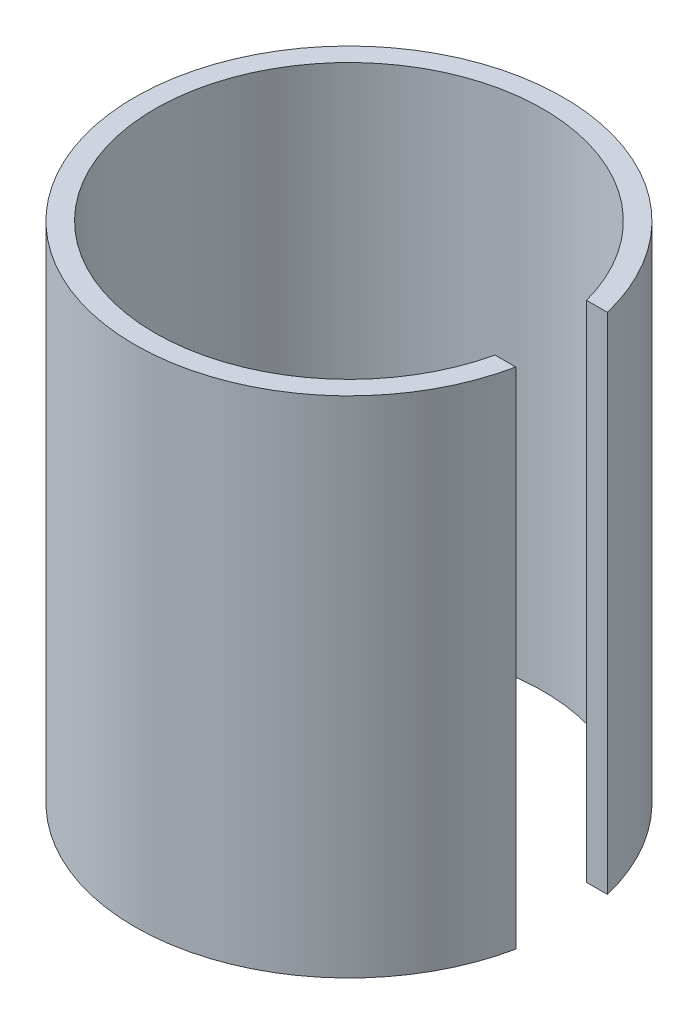
ISO-10303-21;
HEADER;
FILE_DESCRIPTION(('STEP AP214'),'2;1');
FILE_NAME('part.step','',(''),(''),'','','');
FILE_SCHEMA(('AUTOMOTIVE_DESIGN { 1 0 10303 214 1 1 1 1 }'));
ENDSEC;
DATA;
#1=APPLICATION_CONTEXT('core data for automotive mechanical design processes');
#2=APPLICATION_PROTOCOL_DEFINITION('international standard','automotive_design',2000,#1);
#3=PRODUCT_CONTEXT('',#1,'mechanical');
#4=PRODUCT('Part','Part','',(#3));
#5=PRODUCT_RELATED_PRODUCT_CATEGORY('part','',(#4));
#6=PRODUCT_DEFINITION_FORMATION('','',#4);
#7=PRODUCT_DEFINITION_CONTEXT('part definition',#1,'design');
#8=PRODUCT_DEFINITION('design','',#6,#7);
#9=PRODUCT_DEFINITION_SHAPE('','',#8);
#10=(LENGTH_UNIT() NAMED_UNIT(*) SI_UNIT(.MILLI.,.METRE.));
#11=(NAMED_UNIT(*) PLANE_ANGLE_UNIT() SI_UNIT($,.RADIAN.));
#12=(NAMED_UNIT(*) SI_UNIT($,.STERADIAN.) SOLID_ANGLE_UNIT());
#13=UNCERTAINTY_MEASURE_WITH_UNIT(LENGTH_MEASURE(1.E-05),#10,'distance_accuracy_value','');
#14=(GEOMETRIC_REPRESENTATION_CONTEXT(3) GLOBAL_UNCERTAINTY_ASSIGNED_CONTEXT((#13)) GLOBAL_UNIT_ASSIGNED_CONTEXT((#10,
#11,#12)) REPRESENTATION_CONTEXT('',''));
#15=CARTESIAN_POINT('',(0.,0.,0.));
#16=DIRECTION('',(0.,0.,1.));
#17=DIRECTION('',(1.,0.,0.));
#18=AXIS2_PLACEMENT_3D('',#15,#16,#17);
#19=CARTESIAN_POINT('',(0.,200.,0.));
#20=DIRECTION('',(0.,-1.,0.));
#21=DIRECTION('',(0.,0.,-1.));
#22=AXIS2_PLACEMENT_3D('',#19,#20,#21);
#23=CYLINDRICAL_SURFACE('',#22,76.9812408185895);
#24=CARTESIAN_POINT('',(0.,0.,0.));
#25=DIRECTION('',(0.,-1.,0.));
#26=DIRECTION('',(0.,0.,1.));
#27=AXIS2_PLACEMENT_3D('',#24,#25,#26);
#28=CIRCLE('',#27,76.9812408185895);
#29=CARTESIAN_POINT('',(75.0592088835808,0.,17.0946365781977));
#30=VERTEX_POINT('',#29);
#31=CARTESIAN_POINT('',(74.3721587329348,0.,-19.8719260106519));
#32=VERTEX_POINT('',#31);
#33=EDGE_CURVE('E96',#30,#32,#28,.T.);
#34=ORIENTED_EDGE('',*,*,#33,.T.);
#35=DIRECTION('',(0.,-1.,0.));
#36=VECTOR('',#35,1.);
#37=CARTESIAN_POINT('',(74.3721587329348,200.,-19.8719260106519));
#38=LINE('',#37,#36);
#39=CARTESIAN_POINT('',(74.3721587329348,200.,-19.8719260106519));
#40=VERTEX_POINT('',#39);
#41=EDGE_CURVE('E11',#40,#32,#38,.T.);
#42=ORIENTED_EDGE('',*,*,#41,.F.);
#43=CARTESIAN_POINT('',(0.,200.,0.));
#44=DIRECTION('',(0.,-1.,0.));
#45=DIRECTION('',(0.,0.,1.));
#46=AXIS2_PLACEMENT_3D('',#43,#44,#45);
#47=CIRCLE('',#46,76.9812408185895);
#48=CARTESIAN_POINT('',(75.0592088835808,200.,17.0946365781977));
#49=VERTEX_POINT('',#48);
#50=EDGE_CURVE('E84',#49,#40,#47,.T.);
#51=ORIENTED_EDGE('',*,*,#50,.F.);
#52=DIRECTION('',(0.,-1.,0.));
#53=VECTOR('',#52,1.);
#54=CARTESIAN_POINT('',(75.0592088835808,200.,17.0946365781977));
#55=LINE('',#54,#53);
#56=EDGE_CURVE('E92',#49,#30,#55,.T.);
#57=ORIENTED_EDGE('',*,*,#56,.T.);
#58=EDGE_LOOP('',(#34,#42,#51,#57));
#59=FACE_BOUND('',#58,.T.);
#60=ADVANCED_FACE('F33',(#59),#23,.F.);
#61=CARTESIAN_POINT('',(74.3721587329348,200.,-19.8719260106519));
#62=DIRECTION('',(0.,0.,-1.));
#63=DIRECTION('',(-1.,0.,0.));
#64=AXIS2_PLACEMENT_3D('',#61,#62,#63);
#65=PLANE('',#64);
#66=DIRECTION('',(1.,0.,0.));
#67=VECTOR('',#66,1.);
#68=CARTESIAN_POINT('',(74.3721587329348,0.,-19.8719260106519));
#69=LINE('',#68,#67);
#70=CARTESIAN_POINT('',(82.6444587170076,0.,-19.8719260106519));
#71=VERTEX_POINT('',#70);
#72=EDGE_CURVE('E88',#32,#71,#69,.T.);
#73=ORIENTED_EDGE('',*,*,#72,.T.);
#74=DIRECTION('',(0.,-1.,0.));
#75=VECTOR('',#74,1.);
#76=CARTESIAN_POINT('',(82.6444587170076,200.,-19.8719260106519));
#77=LINE('',#76,#75);
#78=CARTESIAN_POINT('',(82.6444587170076,200.,-19.8719260106519));
#79=VERTEX_POINT('',#78);
#80=EDGE_CURVE('E41',#79,#71,#77,.T.);
#81=ORIENTED_EDGE('',*,*,#80,.F.);
#82=DIRECTION('',(1.,0.,0.));
#83=VECTOR('',#82,1.);
#84=CARTESIAN_POINT('',(74.3721587329348,200.,-19.8719260106519));
#85=LINE('',#84,#83);
#86=EDGE_CURVE('E79',#40,#79,#85,.T.);
#87=ORIENTED_EDGE('',*,*,#86,.F.);
#88=ORIENTED_EDGE('',*,*,#41,.T.);
#89=EDGE_LOOP('',(#73,#81,#87,#88));
#90=FACE_BOUND('',#89,.T.);
#91=ADVANCED_FACE('F87',(#90),#65,.F.);
#92=CARTESIAN_POINT('',(0.,200.,0.));
#93=DIRECTION('',(0.,-1.,0.));
#94=DIRECTION('',(0.,0.,-1.));
#95=AXIS2_PLACEMENT_3D('',#92,#93,#94);
#96=CYLINDRICAL_SURFACE('',#95,85.);
#97=CARTESIAN_POINT('',(0.,0.,0.));
#98=DIRECTION('',(0.,1.,0.));
#99=DIRECTION('',(0.,0.,1.));
#100=AXIS2_PLACEMENT_3D('',#97,#98,#99);
#101=CIRCLE('',#100,85.);
#102=CARTESIAN_POINT('',(83.2632776214061,0.,17.0946365781977));
#103=VERTEX_POINT('',#102);
#104=EDGE_CURVE('E66',#71,#103,#101,.T.);
#105=ORIENTED_EDGE('',*,*,#104,.T.);
#106=DIRECTION('',(0.,-1.,0.));
#107=VECTOR('',#106,1.);
#108=CARTESIAN_POINT('',(83.2632776214061,200.,17.0946365781977));
#109=LINE('',#108,#107);
#110=CARTESIAN_POINT('',(83.2632776214061,200.,17.0946365781977));
#111=VERTEX_POINT('',#110);
#112=EDGE_CURVE('E89',#111,#103,#109,.T.);
#113=ORIENTED_EDGE('',*,*,#112,.F.);
#114=CARTESIAN_POINT('',(0.,200.,0.));
#115=DIRECTION('',(0.,1.,0.));
#116=DIRECTION('',(0.,0.,1.));
#117=AXIS2_PLACEMENT_3D('',#114,#115,#116);
#118=CIRCLE('',#117,85.);
#119=EDGE_CURVE('E82',#79,#111,#118,.T.);
#120=ORIENTED_EDGE('',*,*,#119,.F.);
#121=ORIENTED_EDGE('',*,*,#80,.T.);
#122=EDGE_LOOP('',(#105,#113,#120,#121));
#123=FACE_BOUND('',#122,.T.);
#124=ADVANCED_FACE('F90',(#123),#96,.T.);
#125=CARTESIAN_POINT('',(75.0592088835808,200.,17.0946365781977));
#126=DIRECTION('',(0.,0.,1.));
#127=DIRECTION('',(1.,0.,0.));
#128=AXIS2_PLACEMENT_3D('',#125,#126,#127);
#129=PLANE('',#128);
#130=DIRECTION('',(-1.,0.,0.));
#131=VECTOR('',#130,1.);
#132=CARTESIAN_POINT('',(75.0592088835808,0.,17.0946365781977));
#133=LINE('',#132,#131);
#134=EDGE_CURVE('E72',#103,#30,#133,.T.);
#135=ORIENTED_EDGE('',*,*,#134,.T.);
#136=ORIENTED_EDGE('',*,*,#56,.F.);
#137=DIRECTION('',(-1.,0.,0.));
#138=VECTOR('',#137,1.);
#139=CARTESIAN_POINT('',(75.0592088835808,200.,17.0946365781977));
#140=LINE('',#139,#138);
#141=EDGE_CURVE('E49',#111,#49,#140,.T.);
#142=ORIENTED_EDGE('',*,*,#141,.F.);
#143=ORIENTED_EDGE('',*,*,#112,.T.);
#144=EDGE_LOOP('',(#135,#136,#142,#143));
#145=FACE_BOUND('',#144,.T.);
#146=ADVANCED_FACE('F103',(#145),#129,.F.);
#147=CARTESIAN_POINT('',(0.,200.,0.));
#148=DIRECTION('',(0.,1.,0.));
#149=DIRECTION('',(0.,0.,1.));
#150=AXIS2_PLACEMENT_3D('',#147,#148,#149);
#151=PLANE('',#150);
#152=ORIENTED_EDGE('',*,*,#50,.T.);
#153=ORIENTED_EDGE('',*,*,#86,.T.);
#154=ORIENTED_EDGE('',*,*,#119,.T.);
#155=ORIENTED_EDGE('',*,*,#141,.T.);
#156=EDGE_LOOP('',(#152,#153,#154,#155));
#157=FACE_BOUND('',#156,.T.);
#158=ADVANCED_FACE('F80',(#157),#151,.T.);
#159=CARTESIAN_POINT('',(0.,0.,0.));
#160=DIRECTION('',(0.,1.,0.));
#161=DIRECTION('',(0.,0.,1.));
#162=AXIS2_PLACEMENT_3D('',#159,#160,#161);
#163=PLANE('',#162);
#164=ORIENTED_EDGE('',*,*,#33,.F.);
#165=ORIENTED_EDGE('',*,*,#134,.F.);
#166=ORIENTED_EDGE('',*,*,#104,.F.);
#167=ORIENTED_EDGE('',*,*,#72,.F.);
#168=EDGE_LOOP('',(#164,#165,#166,#167));
#169=FACE_BOUND('',#168,.T.);
#170=ADVANCED_FACE('F106',(#169),#163,.F.);
#171=CLOSED_SHELL('',(#60,#91,#124,#146,#158,#170));
#172=MANIFOLD_SOLID_BREP('B2',#171);
#173=ADVANCED_BREP_SHAPE_REPRESENTATION('',(#18,#172),#14);
#174=SHAPE_DEFINITION_REPRESENTATION(#9,#173);
ENDSEC;
END-ISO-10303-21;
